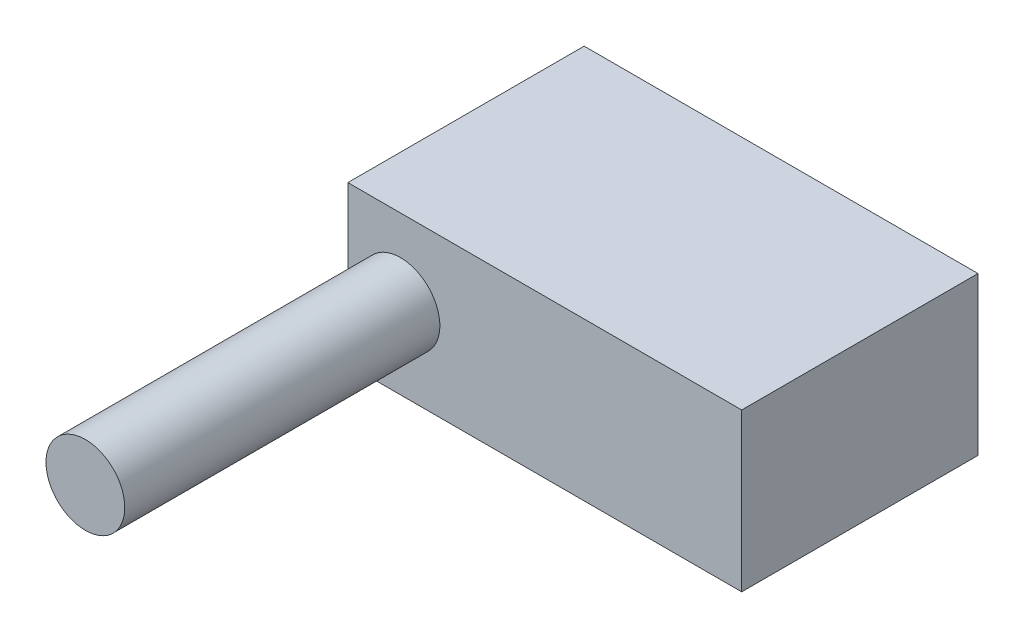
ISO-10303-21;
HEADER;
FILE_DESCRIPTION(('STEP AP214'),'2;1');
FILE_NAME('part.step','',(''),(''),'','','');
FILE_SCHEMA(('AUTOMOTIVE_DESIGN { 1 0 10303 214 1 1 1 1 }'));
ENDSEC;
DATA;
#1=APPLICATION_CONTEXT('core data for automotive mechanical design processes');
#2=APPLICATION_PROTOCOL_DEFINITION('international standard','automotive_design',2000,#1);
#3=PRODUCT_CONTEXT('',#1,'mechanical');
#4=PRODUCT('Part','Part','',(#3));
#5=PRODUCT_RELATED_PRODUCT_CATEGORY('part','',(#4));
#6=PRODUCT_DEFINITION_FORMATION('','',#4);
#7=PRODUCT_DEFINITION_CONTEXT('part definition',#1,'design');
#8=PRODUCT_DEFINITION('design','',#6,#7);
#9=PRODUCT_DEFINITION_SHAPE('','',#8);
#10=(LENGTH_UNIT() NAMED_UNIT(*) SI_UNIT(.MILLI.,.METRE.));
#11=(NAMED_UNIT(*) PLANE_ANGLE_UNIT() SI_UNIT($,.RADIAN.));
#12=(NAMED_UNIT(*) SI_UNIT($,.STERADIAN.) SOLID_ANGLE_UNIT());
#13=UNCERTAINTY_MEASURE_WITH_UNIT(LENGTH_MEASURE(1.E-05),#10,'distance_accuracy_value','');
#14=(GEOMETRIC_REPRESENTATION_CONTEXT(3) GLOBAL_UNCERTAINTY_ASSIGNED_CONTEXT((#13)) GLOBAL_UNIT_ASSIGNED_CONTEXT((#10,
#11,#12)) REPRESENTATION_CONTEXT('',''));
#15=CARTESIAN_POINT('',(0.,0.,0.));
#16=DIRECTION('',(0.,0.,1.));
#17=DIRECTION('',(1.,0.,0.));
#18=AXIS2_PLACEMENT_3D('',#15,#16,#17);
#19=CARTESIAN_POINT('',(25.,20.,15.));
#20=DIRECTION('',(-1.,0.,0.));
#21=DIRECTION('',(0.,0.,1.));
#22=AXIS2_PLACEMENT_3D('',#19,#20,#21);
#23=PLANE('',#22);
#24=DIRECTION('',(0.,0.,-1.));
#25=VECTOR('',#24,1.);
#26=CARTESIAN_POINT('',(25.,0.,15.));
#27=LINE('',#26,#25);
#28=CARTESIAN_POINT('',(25.,0.,15.));
#29=VERTEX_POINT('',#28);
#30=CARTESIAN_POINT('',(25.,0.,-15.));
#31=VERTEX_POINT('',#30);
#32=EDGE_CURVE('E102',#29,#31,#27,.T.);
#33=ORIENTED_EDGE('',*,*,#32,.T.);
#34=DIRECTION('',(0.,-1.,0.));
#35=VECTOR('',#34,1.);
#36=CARTESIAN_POINT('',(25.,20.,-15.));
#37=LINE('',#36,#35);
#38=CARTESIAN_POINT('',(25.,20.,-15.));
#39=VERTEX_POINT('',#38);
#40=EDGE_CURVE('E44',#39,#31,#37,.T.);
#41=ORIENTED_EDGE('',*,*,#40,.F.);
#42=DIRECTION('',(0.,0.,-1.));
#43=VECTOR('',#42,1.);
#44=CARTESIAN_POINT('',(25.,20.,15.));
#45=LINE('',#44,#43);
#46=CARTESIAN_POINT('',(25.,20.,15.));
#47=VERTEX_POINT('',#46);
#48=EDGE_CURVE('E88',#47,#39,#45,.T.);
#49=ORIENTED_EDGE('',*,*,#48,.F.);
#50=DIRECTION('',(0.,-1.,0.));
#51=VECTOR('',#50,1.);
#52=CARTESIAN_POINT('',(25.,20.,15.));
#53=LINE('',#52,#51);
#54=EDGE_CURVE('E98',#47,#29,#53,.T.);
#55=ORIENTED_EDGE('',*,*,#54,.T.);
#56=EDGE_LOOP('',(#33,#41,#49,#55));
#57=FACE_BOUND('',#56,.T.);
#58=ADVANCED_FACE('F36',(#57),#23,.F.);
#59=CARTESIAN_POINT('',(-25.,20.,-15.));
#60=DIRECTION('',(0.,0.,1.));
#61=DIRECTION('',(1.,0.,0.));
#62=AXIS2_PLACEMENT_3D('',#59,#60,#61);
#63=PLANE('',#62);
#64=DIRECTION('',(-1.,0.,0.));
#65=VECTOR('',#64,1.);
#66=CARTESIAN_POINT('',(-25.,0.,-15.));
#67=LINE('',#66,#65);
#68=CARTESIAN_POINT('',(-25.,0.,-15.));
#69=VERTEX_POINT('',#68);
#70=EDGE_CURVE('E93',#31,#69,#67,.T.);
#71=ORIENTED_EDGE('',*,*,#70,.T.);
#72=DIRECTION('',(0.,-1.,0.));
#73=VECTOR('',#72,1.);
#74=CARTESIAN_POINT('',(-25.,20.,-15.));
#75=LINE('',#74,#73);
#76=CARTESIAN_POINT('',(-25.,20.,-15.));
#77=VERTEX_POINT('',#76);
#78=EDGE_CURVE('E91',#77,#69,#75,.T.);
#79=ORIENTED_EDGE('',*,*,#78,.F.);
#80=DIRECTION('',(-1.,0.,0.));
#81=VECTOR('',#80,1.);
#82=CARTESIAN_POINT('',(-25.,20.,-15.));
#83=LINE('',#82,#81);
#84=EDGE_CURVE('E83',#39,#77,#83,.T.);
#85=ORIENTED_EDGE('',*,*,#84,.F.);
#86=ORIENTED_EDGE('',*,*,#40,.T.);
#87=EDGE_LOOP('',(#71,#79,#85,#86));
#88=FACE_BOUND('',#87,.T.);
#89=ADVANCED_FACE('F92',(#88),#63,.F.);
#90=CARTESIAN_POINT('',(-25.,20.,15.));
#91=DIRECTION('',(1.,0.,0.));
#92=DIRECTION('',(0.,0.,-1.));
#93=AXIS2_PLACEMENT_3D('',#90,#91,#92);
#94=PLANE('',#93);
#95=DIRECTION('',(0.,0.,1.));
#96=VECTOR('',#95,1.);
#97=CARTESIAN_POINT('',(-25.,0.,15.));
#98=LINE('',#97,#96);
#99=CARTESIAN_POINT('',(-25.,0.,15.));
#100=VERTEX_POINT('',#99);
#101=EDGE_CURVE('E69',#69,#100,#98,.T.);
#102=ORIENTED_EDGE('',*,*,#101,.T.);
#103=DIRECTION('',(0.,-1.,0.));
#104=VECTOR('',#103,1.);
#105=CARTESIAN_POINT('',(-25.,20.,15.));
#106=LINE('',#105,#104);
#107=CARTESIAN_POINT('',(-25.,20.,15.));
#108=VERTEX_POINT('',#107);
#109=EDGE_CURVE('E94',#108,#100,#106,.T.);
#110=ORIENTED_EDGE('',*,*,#109,.F.);
#111=DIRECTION('',(0.,0.,1.));
#112=VECTOR('',#111,1.);
#113=CARTESIAN_POINT('',(-25.,20.,15.));
#114=LINE('',#113,#112);
#115=EDGE_CURVE('E86',#77,#108,#114,.T.);
#116=ORIENTED_EDGE('',*,*,#115,.F.);
#117=ORIENTED_EDGE('',*,*,#78,.T.);
#118=EDGE_LOOP('',(#102,#110,#116,#117));
#119=FACE_BOUND('',#118,.T.);
#120=ADVANCED_FACE('F96',(#119),#94,.F.);
#121=CARTESIAN_POINT('',(-25.,20.,15.));
#122=DIRECTION('',(0.,0.,-1.));
#123=DIRECTION('',(-1.,0.,0.));
#124=AXIS2_PLACEMENT_3D('',#121,#122,#123);
#125=PLANE('',#124);
#126=CARTESIAN_POINT('',(-18.3212916776931,10.095867223895,15.));
#127=DIRECTION('',(0.,0.,-1.));
#128=DIRECTION('',(-1.,0.,0.));
#129=AXIS2_PLACEMENT_3D('',#126,#127,#128);
#130=CIRCLE('',#129,5.);
#131=CARTESIAN_POINT('',(-23.3212916776931,10.095867223895,15.));
#132=VERTEX_POINT('',#131);
#133=EDGE_CURVE('E11',#132,#132,#130,.F.);
#134=ORIENTED_EDGE('',*,*,#133,.F.);
#135=EDGE_LOOP('',(#134));
#136=FACE_BOUND('',#135,.T.);
#137=DIRECTION('',(1.,0.,0.));
#138=VECTOR('',#137,1.);
#139=CARTESIAN_POINT('',(-25.,0.,15.));
#140=LINE('',#139,#138);
#141=EDGE_CURVE('E75',#100,#29,#140,.T.);
#142=ORIENTED_EDGE('',*,*,#141,.T.);
#143=ORIENTED_EDGE('',*,*,#54,.F.);
#144=DIRECTION('',(1.,0.,0.));
#145=VECTOR('',#144,1.);
#146=CARTESIAN_POINT('',(-25.,20.,15.));
#147=LINE('',#146,#145);
#148=EDGE_CURVE('E52',#108,#47,#147,.T.);
#149=ORIENTED_EDGE('',*,*,#148,.F.);
#150=ORIENTED_EDGE('',*,*,#109,.T.);
#151=EDGE_LOOP('',(#142,#143,#149,#150));
#152=FACE_BOUND('',#151,.T.);
#153=ADVANCED_FACE('F124',(#136,#152),#125,.F.);
#154=CARTESIAN_POINT('',(0.,20.,0.));
#155=DIRECTION('',(0.,-1.,0.));
#156=DIRECTION('',(0.,0.,-1.));
#157=AXIS2_PLACEMENT_3D('',#154,#155,#156);
#158=PLANE('',#157);
#159=ORIENTED_EDGE('',*,*,#48,.T.);
#160=ORIENTED_EDGE('',*,*,#84,.T.);
#161=ORIENTED_EDGE('',*,*,#115,.T.);
#162=ORIENTED_EDGE('',*,*,#148,.T.);
#163=EDGE_LOOP('',(#159,#160,#161,#162));
#164=FACE_BOUND('',#163,.T.);
#165=ADVANCED_FACE('F84',(#164),#158,.F.);
#166=CARTESIAN_POINT('',(0.,0.,0.));
#167=DIRECTION('',(0.,-1.,0.));
#168=DIRECTION('',(0.,0.,-1.));
#169=AXIS2_PLACEMENT_3D('',#166,#167,#168);
#170=PLANE('',#169);
#171=ORIENTED_EDGE('',*,*,#32,.F.);
#172=ORIENTED_EDGE('',*,*,#141,.F.);
#173=ORIENTED_EDGE('',*,*,#101,.F.);
#174=ORIENTED_EDGE('',*,*,#70,.F.);
#175=EDGE_LOOP('',(#171,#172,#173,#174));
#176=FACE_BOUND('',#175,.T.);
#177=ADVANCED_FACE('F113',(#176),#170,.T.);
#178=CARTESIAN_POINT('',(-18.3212916776931,10.095867223895,55.));
#179=DIRECTION('',(0.,0.,-1.));
#180=DIRECTION('',(-1.,0.,0.));
#181=AXIS2_PLACEMENT_3D('',#178,#179,#180);
#182=CYLINDRICAL_SURFACE('',#181,5.);
#183=CARTESIAN_POINT('',(-18.3212916776931,10.095867223895,55.));
#184=DIRECTION('',(0.,0.,1.));
#185=DIRECTION('',(1.,0.,0.));
#186=AXIS2_PLACEMENT_3D('',#183,#184,#185);
#187=CIRCLE('',#186,5.);
#188=CARTESIAN_POINT('',(-13.3212916776931,10.095867223895,55.));
#189=VERTEX_POINT('',#188);
#190=EDGE_CURVE('E105',#189,#189,#187,.T.);
#191=ORIENTED_EDGE('',*,*,#190,.F.);
#192=EDGE_LOOP('',(#191));
#193=FACE_BOUND('',#192,.T.);
#194=ORIENTED_EDGE('',*,*,#133,.T.);
#195=EDGE_LOOP('',(#194));
#196=FACE_BOUND('',#195,.T.);
#197=ADVANCED_FACE('F115',(#193,#196),#182,.T.);
#198=CARTESIAN_POINT('',(-18.3212916776931,10.095867223895,55.));
#199=DIRECTION('',(0.,0.,1.));
#200=DIRECTION('',(1.,0.,0.));
#201=AXIS2_PLACEMENT_3D('',#198,#199,#200);
#202=PLANE('',#201);
#203=ORIENTED_EDGE('',*,*,#190,.T.);
#204=EDGE_LOOP('',(#203));
#205=FACE_BOUND('',#204,.T.);
#206=ADVANCED_FACE('F121',(#205),#202,.T.);
#207=CLOSED_SHELL('',(#58,#89,#120,#153,#165,#177,#197,#206));
#208=MANIFOLD_SOLID_BREP('B2',#207);
#209=ADVANCED_BREP_SHAPE_REPRESENTATION('',(#18,#208),#14);
#210=SHAPE_DEFINITION_REPRESENTATION(#9,#209);
ENDSEC;
END-ISO-10303-21;
